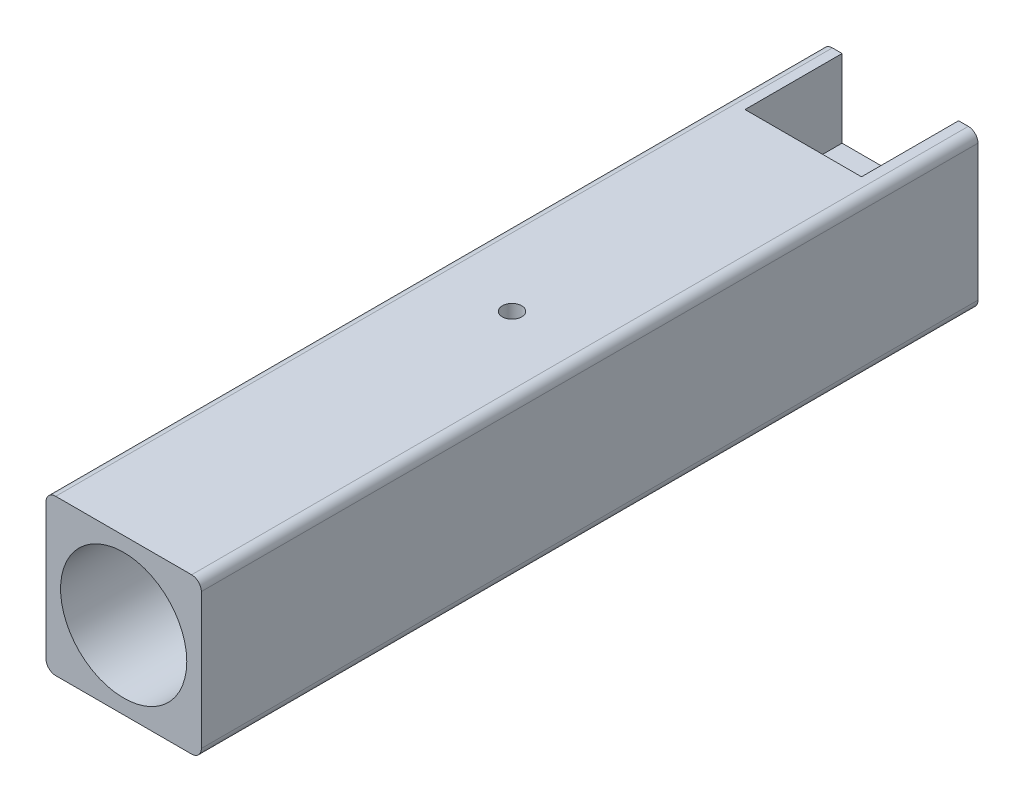
ISO-10303-21;
HEADER;
FILE_DESCRIPTION(('STEP AP214'),'2;1');
FILE_NAME('part.step','',(''),(''),'','','');
FILE_SCHEMA(('AUTOMOTIVE_DESIGN { 1 0 10303 214 1 1 1 1 }'));
ENDSEC;
DATA;
#1=APPLICATION_CONTEXT('core data for automotive mechanical design processes');
#2=APPLICATION_PROTOCOL_DEFINITION('international standard','automotive_design',2000,#1);
#3=PRODUCT_CONTEXT('',#1,'mechanical');
#4=PRODUCT('Part','Part','',(#3));
#5=PRODUCT_RELATED_PRODUCT_CATEGORY('part','',(#4));
#6=PRODUCT_DEFINITION_FORMATION('','',#4);
#7=PRODUCT_DEFINITION_CONTEXT('part definition',#1,'design');
#8=PRODUCT_DEFINITION('design','',#6,#7);
#9=PRODUCT_DEFINITION_SHAPE('','',#8);
#10=(LENGTH_UNIT() NAMED_UNIT(*) SI_UNIT(.MILLI.,.METRE.));
#11=(NAMED_UNIT(*) PLANE_ANGLE_UNIT() SI_UNIT($,.RADIAN.));
#12=(NAMED_UNIT(*) SI_UNIT($,.STERADIAN.) SOLID_ANGLE_UNIT());
#13=UNCERTAINTY_MEASURE_WITH_UNIT(LENGTH_MEASURE(1.E-05),#10,'distance_accuracy_value','');
#14=(GEOMETRIC_REPRESENTATION_CONTEXT(3) GLOBAL_UNCERTAINTY_ASSIGNED_CONTEXT((#13)) GLOBAL_UNIT_ASSIGNED_CONTEXT((#10,
#11,#12)) REPRESENTATION_CONTEXT('',''));
#15=CARTESIAN_POINT('',(0.,0.,0.));
#16=DIRECTION('',(0.,0.,1.));
#17=DIRECTION('',(1.,0.,0.));
#18=AXIS2_PLACEMENT_3D('',#15,#16,#17);
#19=CARTESIAN_POINT('',(0.,0.,80.));
#20=DIRECTION('',(1.,0.,0.));
#21=DIRECTION('',(0.,1.,0.));
#22=AXIS2_PLACEMENT_3D('',#19,#20,#21);
#23=PLANE('',#22);
#24=DIRECTION('',(0.,-1.,0.));
#25=VECTOR('',#24,1.);
#26=CARTESIAN_POINT('',(0.,0.,80.));
#27=LINE('',#26,#25);
#28=CARTESIAN_POINT('',(0.,-1.,80.));
#29=VERTEX_POINT('',#28);
#30=CARTESIAN_POINT('',(0.,-15.,80.));
#31=VERTEX_POINT('',#30);
#32=EDGE_CURVE('E260',#29,#31,#27,.T.);
#33=ORIENTED_EDGE('',*,*,#32,.F.);
#34=DIRECTION('',(0.,0.,-1.));
#35=VECTOR('',#34,1.);
#36=CARTESIAN_POINT('',(0.,-1.,80.));
#37=LINE('',#36,#35);
#38=CARTESIAN_POINT('',(0.,-1.,0.));
#39=VERTEX_POINT('',#38);
#40=EDGE_CURVE('E11',#29,#39,#37,.T.);
#41=ORIENTED_EDGE('',*,*,#40,.T.);
#42=DIRECTION('',(0.,-1.,0.));
#43=VECTOR('',#42,1.);
#44=CARTESIAN_POINT('',(0.,0.,0.));
#45=LINE('',#44,#43);
#46=CARTESIAN_POINT('',(0.,-15.,0.));
#47=VERTEX_POINT('',#46);
#48=EDGE_CURVE('E256',#39,#47,#45,.T.);
#49=ORIENTED_EDGE('',*,*,#48,.T.);
#50=DIRECTION('',(0.,0.,-1.));
#51=VECTOR('',#50,1.);
#52=CARTESIAN_POINT('',(0.,-15.,80.));
#53=LINE('',#52,#51);
#54=EDGE_CURVE('E48',#47,#31,#53,.F.);
#55=ORIENTED_EDGE('',*,*,#54,.T.);
#56=EDGE_LOOP('',(#33,#41,#49,#55));
#57=FACE_BOUND('',#56,.T.);
#58=ADVANCED_FACE('F39',(#57),#23,.F.);
#59=CARTESIAN_POINT('',(0.,-16.,80.));
#60=DIRECTION('',(0.,1.,0.));
#61=DIRECTION('',(0.,0.,1.));
#62=AXIS2_PLACEMENT_3D('',#59,#60,#61);
#63=PLANE('',#62);
#64=DIRECTION('',(1.,0.,0.));
#65=VECTOR('',#64,1.);
#66=CARTESIAN_POINT('',(0.,-16.,0.));
#67=LINE('',#66,#65);
#68=CARTESIAN_POINT('',(14.,-16.,0.));
#69=VERTEX_POINT('',#68);
#70=CARTESIAN_POINT('',(15.,-16.,0.));
#71=VERTEX_POINT('',#70);
#72=EDGE_CURVE('E279',#69,#71,#67,.T.);
#73=ORIENTED_EDGE('',*,*,#72,.T.);
#74=DIRECTION('',(0.,0.,-1.));
#75=VECTOR('',#74,1.);
#76=CARTESIAN_POINT('',(15.,-16.,80.));
#77=LINE('',#76,#75);
#78=CARTESIAN_POINT('',(15.,-16.,80.));
#79=VERTEX_POINT('',#78);
#80=EDGE_CURVE('E312',#71,#79,#77,.F.);
#81=ORIENTED_EDGE('',*,*,#80,.T.);
#82=DIRECTION('',(1.,0.,0.));
#83=VECTOR('',#82,1.);
#84=CARTESIAN_POINT('',(0.,-16.,80.));
#85=LINE('',#84,#83);
#86=CARTESIAN_POINT('',(1.,-16.,80.));
#87=VERTEX_POINT('',#86);
#88=EDGE_CURVE('E264',#87,#79,#85,.T.);
#89=ORIENTED_EDGE('',*,*,#88,.F.);
#90=DIRECTION('',(0.,0.,-1.));
#91=VECTOR('',#90,1.);
#92=CARTESIAN_POINT('',(1.,-16.,80.));
#93=LINE('',#92,#91);
#94=CARTESIAN_POINT('',(1.,-16.,0.));
#95=VERTEX_POINT('',#94);
#96=EDGE_CURVE('E308',#87,#95,#93,.T.);
#97=ORIENTED_EDGE('',*,*,#96,.T.);
#98=CARTESIAN_POINT('',(2.,-16.,0.));
#99=VERTEX_POINT('',#98);
#100=EDGE_CURVE('E280',#95,#99,#67,.T.);
#101=ORIENTED_EDGE('',*,*,#100,.T.);
#102=DIRECTION('',(0.,0.,-1.));
#103=VECTOR('',#102,1.);
#104=CARTESIAN_POINT('',(2.,-16.,10.));
#105=LINE('',#104,#103);
#106=CARTESIAN_POINT('',(2.,-16.,10.));
#107=VERTEX_POINT('',#106);
#108=EDGE_CURVE('E198',#107,#99,#105,.T.);
#109=ORIENTED_EDGE('',*,*,#108,.F.);
#110=DIRECTION('',(-1.,0.,0.));
#111=VECTOR('',#110,1.);
#112=CARTESIAN_POINT('',(14.,-16.,10.));
#113=LINE('',#112,#111);
#114=CARTESIAN_POINT('',(14.,-16.,10.));
#115=VERTEX_POINT('',#114);
#116=EDGE_CURVE('E224',#115,#107,#113,.T.);
#117=ORIENTED_EDGE('',*,*,#116,.F.);
#118=DIRECTION('',(0.,0.,-1.));
#119=VECTOR('',#118,1.);
#120=CARTESIAN_POINT('',(14.,-16.,10.));
#121=LINE('',#120,#119);
#122=EDGE_CURVE('E242',#115,#69,#121,.T.);
#123=ORIENTED_EDGE('',*,*,#122,.T.);
#124=EDGE_LOOP('',(#73,#81,#89,#97,#101,#109,#117,#123));
#125=FACE_BOUND('',#124,.T.);
#126=ADVANCED_FACE('F346',(#125),#63,.F.);
#127=CARTESIAN_POINT('',(16.,0.,80.));
#128=DIRECTION('',(-1.,0.,0.));
#129=DIRECTION('',(0.,-1.,0.));
#130=AXIS2_PLACEMENT_3D('',#127,#128,#129);
#131=PLANE('',#130);
#132=DIRECTION('',(0.,1.,0.));
#133=VECTOR('',#132,1.);
#134=CARTESIAN_POINT('',(16.,0.,80.));
#135=LINE('',#134,#133);
#136=CARTESIAN_POINT('',(16.,-15.,80.));
#137=VERTEX_POINT('',#136);
#138=CARTESIAN_POINT('',(16.,-1.,80.));
#139=VERTEX_POINT('',#138);
#140=EDGE_CURVE('E269',#137,#139,#135,.T.);
#141=ORIENTED_EDGE('',*,*,#140,.F.);
#142=DIRECTION('',(0.,0.,-1.));
#143=VECTOR('',#142,1.);
#144=CARTESIAN_POINT('',(16.,-15.,80.));
#145=LINE('',#144,#143);
#146=CARTESIAN_POINT('',(16.,-15.,0.));
#147=VERTEX_POINT('',#146);
#148=EDGE_CURVE('E292',#137,#147,#145,.T.);
#149=ORIENTED_EDGE('',*,*,#148,.T.);
#150=DIRECTION('',(0.,1.,0.));
#151=VECTOR('',#150,1.);
#152=CARTESIAN_POINT('',(16.,0.,0.));
#153=LINE('',#152,#151);
#154=CARTESIAN_POINT('',(16.,-1.,0.));
#155=VERTEX_POINT('',#154);
#156=EDGE_CURVE('E283',#147,#155,#153,.T.);
#157=ORIENTED_EDGE('',*,*,#156,.T.);
#158=DIRECTION('',(0.,0.,-1.));
#159=VECTOR('',#158,1.);
#160=CARTESIAN_POINT('',(16.,-1.,80.));
#161=LINE('',#160,#159);
#162=EDGE_CURVE('E275',#155,#139,#161,.F.);
#163=ORIENTED_EDGE('',*,*,#162,.T.);
#164=EDGE_LOOP('',(#141,#149,#157,#163));
#165=FACE_BOUND('',#164,.T.);
#166=ADVANCED_FACE('F387',(#165),#131,.F.);
#167=CARTESIAN_POINT('',(0.,0.,80.));
#168=DIRECTION('',(0.,-1.,0.));
#169=DIRECTION('',(0.,0.,-1.));
#170=AXIS2_PLACEMENT_3D('',#167,#168,#169);
#171=PLANE('',#170);
#172=CARTESIAN_POINT('',(8.,0.,40.));
#173=DIRECTION('',(0.,1.,0.));
#174=DIRECTION('',(0.,0.,1.));
#175=AXIS2_PLACEMENT_3D('',#172,#173,#174);
#176=CIRCLE('',#175,1.);
#177=CARTESIAN_POINT('',(8.,0.,41.));
#178=VERTEX_POINT('',#177);
#179=EDGE_CURVE('E604',#178,#178,#176,.T.);
#180=ORIENTED_EDGE('',*,*,#179,.F.);
#181=EDGE_LOOP('',(#180));
#182=FACE_BOUND('',#181,.T.);
#183=DIRECTION('',(-1.,0.,0.));
#184=VECTOR('',#183,1.);
#185=CARTESIAN_POINT('',(0.,0.,80.));
#186=LINE('',#185,#184);
#187=CARTESIAN_POINT('',(15.,0.,80.));
#188=VERTEX_POINT('',#187);
#189=CARTESIAN_POINT('',(1.,0.,80.));
#190=VERTEX_POINT('',#189);
#191=EDGE_CURVE('E272',#188,#190,#186,.T.);
#192=ORIENTED_EDGE('',*,*,#191,.F.);
#193=DIRECTION('',(0.,0.,-1.));
#194=VECTOR('',#193,1.);
#195=CARTESIAN_POINT('',(15.,0.,80.));
#196=LINE('',#195,#194);
#197=CARTESIAN_POINT('',(15.,0.,0.));
#198=VERTEX_POINT('',#197);
#199=EDGE_CURVE('E328',#188,#198,#196,.T.);
#200=ORIENTED_EDGE('',*,*,#199,.T.);
#201=DIRECTION('',(-1.,0.,0.));
#202=VECTOR('',#201,1.);
#203=CARTESIAN_POINT('',(0.,0.,0.));
#204=LINE('',#203,#202);
#205=CARTESIAN_POINT('',(14.,0.,0.));
#206=VERTEX_POINT('',#205);
#207=EDGE_CURVE('E265',#198,#206,#204,.T.);
#208=ORIENTED_EDGE('',*,*,#207,.T.);
#209=DIRECTION('',(0.,0.,-1.));
#210=VECTOR('',#209,1.);
#211=CARTESIAN_POINT('',(14.,0.,10.));
#212=LINE('',#211,#210);
#213=CARTESIAN_POINT('',(14.,0.,10.));
#214=VERTEX_POINT('',#213);
#215=EDGE_CURVE('E201',#214,#206,#212,.T.);
#216=ORIENTED_EDGE('',*,*,#215,.F.);
#217=DIRECTION('',(1.,0.,0.));
#218=VECTOR('',#217,1.);
#219=CARTESIAN_POINT('',(14.,0.,10.));
#220=LINE('',#219,#218);
#221=CARTESIAN_POINT('',(2.,0.,10.));
#222=VERTEX_POINT('',#221);
#223=EDGE_CURVE('E168',#222,#214,#220,.T.);
#224=ORIENTED_EDGE('',*,*,#223,.F.);
#225=DIRECTION('',(0.,0.,-1.));
#226=VECTOR('',#225,1.);
#227=CARTESIAN_POINT('',(2.,0.,10.));
#228=LINE('',#227,#226);
#229=CARTESIAN_POINT('',(2.,0.,0.));
#230=VERTEX_POINT('',#229);
#231=EDGE_CURVE('E205',#222,#230,#228,.T.);
#232=ORIENTED_EDGE('',*,*,#231,.T.);
#233=CARTESIAN_POINT('',(1.,0.,0.));
#234=VERTEX_POINT('',#233);
#235=EDGE_CURVE('E287',#230,#234,#204,.T.);
#236=ORIENTED_EDGE('',*,*,#235,.T.);
#237=DIRECTION('',(0.,0.,-1.));
#238=VECTOR('',#237,1.);
#239=CARTESIAN_POINT('',(1.,0.,80.));
#240=LINE('',#239,#238);
#241=EDGE_CURVE('E55',#234,#190,#240,.F.);
#242=ORIENTED_EDGE('',*,*,#241,.T.);
#243=EDGE_LOOP('',(#192,#200,#208,#216,#224,#232,#236,#242));
#244=FACE_BOUND('',#243,.T.);
#245=ADVANCED_FACE('F369',(#182,#244),#171,.F.);
#246=CARTESIAN_POINT('',(0.,0.,80.));
#247=DIRECTION('',(0.,0.,1.));
#248=DIRECTION('',(1.,0.,0.));
#249=AXIS2_PLACEMENT_3D('',#246,#247,#248);
#250=PLANE('',#249);
#251=CARTESIAN_POINT('',(8.,-8.,80.));
#252=DIRECTION('',(0.,0.,1.));
#253=DIRECTION('',(1.,0.,0.));
#254=AXIS2_PLACEMENT_3D('',#251,#252,#253);
#255=CIRCLE('',#254,6.5);
#256=CARTESIAN_POINT('',(14.5,-8.,80.));
#257=VERTEX_POINT('',#256);
#258=EDGE_CURVE('E204',#257,#257,#255,.T.);
#259=ORIENTED_EDGE('',*,*,#258,.F.);
#260=EDGE_LOOP('',(#259));
#261=FACE_BOUND('',#260,.T.);
#262=ORIENTED_EDGE('',*,*,#88,.T.);
#263=CARTESIAN_POINT('',(15.,-15.,80.));
#264=DIRECTION('',(0.,0.,1.));
#265=DIRECTION('',(1.,0.,0.));
#266=AXIS2_PLACEMENT_3D('',#263,#264,#265);
#267=CIRCLE('',#266,1.);
#268=EDGE_CURVE('E323',#79,#137,#267,.T.);
#269=ORIENTED_EDGE('',*,*,#268,.T.);
#270=ORIENTED_EDGE('',*,*,#140,.T.);
#271=CARTESIAN_POINT('',(15.,-1.,80.));
#272=DIRECTION('',(0.,0.,1.));
#273=DIRECTION('',(1.,0.,0.));
#274=AXIS2_PLACEMENT_3D('',#271,#272,#273);
#275=CIRCLE('',#274,1.);
#276=EDGE_CURVE('E62',#139,#188,#275,.T.);
#277=ORIENTED_EDGE('',*,*,#276,.T.);
#278=ORIENTED_EDGE('',*,*,#191,.T.);
#279=CARTESIAN_POINT('',(1.,-1.,80.));
#280=DIRECTION('',(0.,0.,1.));
#281=DIRECTION('',(1.,0.,0.));
#282=AXIS2_PLACEMENT_3D('',#279,#280,#281);
#283=CIRCLE('',#282,1.);
#284=EDGE_CURVE('E318',#190,#29,#283,.T.);
#285=ORIENTED_EDGE('',*,*,#284,.T.);
#286=ORIENTED_EDGE('',*,*,#32,.T.);
#287=CARTESIAN_POINT('',(1.,-15.,80.));
#288=DIRECTION('',(0.,0.,1.));
#289=DIRECTION('',(1.,0.,0.));
#290=AXIS2_PLACEMENT_3D('',#287,#288,#289);
#291=CIRCLE('',#290,1.);
#292=EDGE_CURVE('E315',#31,#87,#291,.T.);
#293=ORIENTED_EDGE('',*,*,#292,.T.);
#294=EDGE_LOOP('',(#262,#269,#270,#277,#278,#285,#286,#293));
#295=FACE_BOUND('',#294,.T.);
#296=ADVANCED_FACE('F339',(#261,#295),#250,.T.);
#297=CARTESIAN_POINT('',(0.,0.,0.));
#298=DIRECTION('',(0.,0.,1.));
#299=DIRECTION('',(1.,0.,0.));
#300=AXIS2_PLACEMENT_3D('',#297,#298,#299);
#301=PLANE('',#300);
#302=ORIENTED_EDGE('',*,*,#156,.F.);
#303=CARTESIAN_POINT('',(15.,-15.,0.));
#304=DIRECTION('',(0.,0.,1.));
#305=DIRECTION('',(1.,0.,0.));
#306=AXIS2_PLACEMENT_3D('',#303,#304,#305);
#307=CIRCLE('',#306,1.);
#308=EDGE_CURVE('E305',#147,#71,#307,.F.);
#309=ORIENTED_EDGE('',*,*,#308,.T.);
#310=ORIENTED_EDGE('',*,*,#72,.F.);
#311=DIRECTION('',(0.,-1.,0.));
#312=VECTOR('',#311,1.);
#313=CARTESIAN_POINT('',(14.,-13.,0.));
#314=LINE('',#313,#312);
#315=CARTESIAN_POINT('',(14.,-13.,0.));
#316=VERTEX_POINT('',#315);
#317=EDGE_CURVE('E216',#316,#69,#314,.T.);
#318=ORIENTED_EDGE('',*,*,#317,.F.);
#319=DIRECTION('',(1.,0.,0.));
#320=VECTOR('',#319,1.);
#321=CARTESIAN_POINT('',(14.,-13.,0.));
#322=LINE('',#321,#320);
#323=CARTESIAN_POINT('',(2.,-13.,0.));
#324=VERTEX_POINT('',#323);
#325=EDGE_CURVE('E232',#324,#316,#322,.T.);
#326=ORIENTED_EDGE('',*,*,#325,.F.);
#327=DIRECTION('',(0.,1.,0.));
#328=VECTOR('',#327,1.);
#329=CARTESIAN_POINT('',(2.,-13.,0.));
#330=LINE('',#329,#328);
#331=EDGE_CURVE('E229',#99,#324,#330,.T.);
#332=ORIENTED_EDGE('',*,*,#331,.F.);
#333=ORIENTED_EDGE('',*,*,#100,.F.);
#334=CARTESIAN_POINT('',(1.,-15.,0.));
#335=DIRECTION('',(0.,0.,1.));
#336=DIRECTION('',(1.,0.,0.));
#337=AXIS2_PLACEMENT_3D('',#334,#335,#336);
#338=CIRCLE('',#337,1.);
#339=EDGE_CURVE('E296',#95,#47,#338,.F.);
#340=ORIENTED_EDGE('',*,*,#339,.T.);
#341=ORIENTED_EDGE('',*,*,#48,.F.);
#342=CARTESIAN_POINT('',(1.,-1.,0.));
#343=DIRECTION('',(0.,0.,1.));
#344=DIRECTION('',(1.,0.,0.));
#345=AXIS2_PLACEMENT_3D('',#342,#343,#344);
#346=CIRCLE('',#345,1.);
#347=EDGE_CURVE('E299',#39,#234,#346,.F.);
#348=ORIENTED_EDGE('',*,*,#347,.T.);
#349=ORIENTED_EDGE('',*,*,#235,.F.);
#350=DIRECTION('',(0.,1.,0.));
#351=VECTOR('',#350,1.);
#352=CARTESIAN_POINT('',(2.,0.,0.));
#353=LINE('',#352,#351);
#354=CARTESIAN_POINT('',(2.,-8.,0.));
#355=VERTEX_POINT('',#354);
#356=EDGE_CURVE('E183',#355,#230,#353,.T.);
#357=ORIENTED_EDGE('',*,*,#356,.F.);
#358=DIRECTION('',(-1.,0.,0.));
#359=VECTOR('',#358,1.);
#360=CARTESIAN_POINT('',(14.,-8.,0.));
#361=LINE('',#360,#359);
#362=CARTESIAN_POINT('',(14.,-8.,0.));
#363=VERTEX_POINT('',#362);
#364=EDGE_CURVE('E186',#363,#355,#361,.T.);
#365=ORIENTED_EDGE('',*,*,#364,.F.);
#366=DIRECTION('',(0.,-1.,0.));
#367=VECTOR('',#366,1.);
#368=CARTESIAN_POINT('',(14.,0.,0.));
#369=LINE('',#368,#367);
#370=EDGE_CURVE('E162',#206,#363,#369,.T.);
#371=ORIENTED_EDGE('',*,*,#370,.F.);
#372=ORIENTED_EDGE('',*,*,#207,.F.);
#373=CARTESIAN_POINT('',(15.,-1.,0.));
#374=DIRECTION('',(0.,0.,1.));
#375=DIRECTION('',(1.,0.,0.));
#376=AXIS2_PLACEMENT_3D('',#373,#374,#375);
#377=CIRCLE('',#376,1.);
#378=EDGE_CURVE('E302',#198,#155,#377,.F.);
#379=ORIENTED_EDGE('',*,*,#378,.T.);
#380=EDGE_LOOP('',(#302,#309,#310,#318,#326,#332,#333,#340,#341,#348,#349,#357,#365,#371,#372,#379));
#381=FACE_BOUND('',#380,.T.);
#382=ADVANCED_FACE('F351',(#381),#301,.F.);
#383=CARTESIAN_POINT('',(8.,-8.,30.));
#384=DIRECTION('',(0.,0.,1.));
#385=DIRECTION('',(1.,0.,0.));
#386=AXIS2_PLACEMENT_3D('',#383,#384,#385);
#387=CYLINDRICAL_SURFACE('',#386,6.5);
#388=CARTESIAN_POINT('',(8.,-1.5,41.));
#389=CARTESIAN_POINT('',(7.94418293527011,-1.50000091007833,40.9999977115017));
#390=CARTESIAN_POINT('',(7.88833390853544,-1.50072649656726,40.9953109036835));
#391=CARTESIAN_POINT('',(7.778198100176,-1.50355116436071,40.9766929268117));
#392=CARTESIAN_POINT('',(7.72391287338665,-1.50565156651803,40.9627528675239));
#393=CARTESIAN_POINT('',(7.61851438911649,-1.51098992748212,40.9260557776658));
#394=CARTESIAN_POINT('',(7.56739872528542,-1.51422701055826,40.9033055333236));
#395=CARTESIAN_POINT('',(7.46971791472895,-1.52148143015368,40.8496507225243));
#396=CARTESIAN_POINT('',(7.4231521620281,-1.52549866255604,40.8187472439817));
#397=CARTESIAN_POINT('',(7.33550361398763,-1.53390379844021,40.749393273145));
#398=CARTESIAN_POINT('',(7.29446353926895,-1.53829420454649,40.7108890887262));
#399=CARTESIAN_POINT('',(7.21940000881251,-1.54693137043103,40.6275422491858));
#400=CARTESIAN_POINT('',(7.18537696508785,-1.55117812176221,40.5826992221322));
#401=CARTESIAN_POINT('',(7.12514587882975,-1.55907141519071,40.4876591386071));
#402=CARTESIAN_POINT('',(7.09897937484975,-1.56271472290099,40.4374354653675));
#403=CARTESIAN_POINT('',(7.05546963337092,-1.56895432313369,40.3332405604673));
#404=CARTESIAN_POINT('',(7.03812588970214,-1.57155067571913,40.2792695439973));
#405=CARTESIAN_POINT('',(7.01288710433819,-1.5753777211851,40.1695621045227));
#406=CARTESIAN_POINT('',(7.00491878262112,-1.57661899998033,40.1138429160574));
#407=CARTESIAN_POINT('',(6.99842997534258,-1.57762746720937,40.0018455350476));
#408=CARTESIAN_POINT('',(6.99990891948757,-1.57739474462272,39.9455673764507));
#409=CARTESIAN_POINT('',(7.01221282018818,-1.57549118066874,39.8345684481683));
#410=CARTESIAN_POINT('',(7.02295600555835,-1.57383292224551,39.7798383674451));
#411=CARTESIAN_POINT('',(7.05335535302759,-1.56928479564967,39.6729669588678));
#412=CARTESIAN_POINT('',(7.07301177922297,-1.56639489098396,39.6208257077707));
#413=CARTESIAN_POINT('',(7.12076420491597,-1.55969526041189,39.5203641511495));
#414=CARTESIAN_POINT('',(7.1488946891951,-1.55588178876613,39.4720604973275));
#415=CARTESIAN_POINT('',(7.21277216762589,-1.5477673896381,39.3808281253323));
#416=CARTESIAN_POINT('',(7.2485196872089,-1.54346642853787,39.337899778278));
#417=CARTESIAN_POINT('',(7.32706461294525,-1.53480613243941,39.2581628113787));
#418=CARTESIAN_POINT('',(7.36993229137565,-1.530446659662,39.2214233929631));
#419=CARTESIAN_POINT('',(7.46126158213438,-1.52220255958654,39.1556495480845));
#420=CARTESIAN_POINT('',(7.50972322131474,-1.51831793456803,39.1266151586093));
#421=CARTESIAN_POINT('',(7.61092589538906,-1.511456854546,39.0770713874046));
#422=CARTESIAN_POINT('',(7.66366967036832,-1.50848098693611,39.0565675164579));
#423=CARTESIAN_POINT('',(7.77190795915462,-1.503777585527,39.0247278716282));
#424=CARTESIAN_POINT('',(7.82740227694362,-1.50204996290763,39.0133914454194));
#425=CARTESIAN_POINT('',(7.93896929317186,-1.50004951119551,39.0003009059104));
#426=CARTESIAN_POINT('',(7.99503058292585,-1.49976224355701,38.998451685667));
#427=CARTESIAN_POINT('',(8.10666252934637,-1.50063551210768,39.0041353598021));
#428=CARTESIAN_POINT('',(8.16223320195536,-1.50179600107675,39.011667948183));
#429=CARTESIAN_POINT('',(8.27101712424826,-1.50542545810717,39.0358223253044));
#430=CARTESIAN_POINT('',(8.32424094186449,-1.50788772976769,39.0523976119831));
#431=CARTESIAN_POINT('',(8.42715414396984,-1.51384561301543,39.0941177171811));
#432=CARTESIAN_POINT('',(8.47684335492824,-1.51734127529337,39.1192629560898));
#433=CARTESIAN_POINT('',(8.57169392957572,-1.52501350116668,39.1776311333932));
#434=CARTESIAN_POINT('',(8.61681788249644,-1.52919505303499,39.2109141978776));
#435=CARTESIAN_POINT('',(8.70087369759262,-1.53775855790866,39.2845297547096));
#436=CARTESIAN_POINT('',(8.73980517987215,-1.54214052318778,39.324862679234));
#437=CARTESIAN_POINT('',(8.81071843588531,-1.55065696523141,39.4118571654747));
#438=CARTESIAN_POINT('',(8.84263634127065,-1.55478893767585,39.458571072027));
#439=CARTESIAN_POINT('',(8.89817200187627,-1.56229266952366,39.5567531882258));
#440=CARTESIAN_POINT('',(8.92178999039054,-1.56566445029353,39.6082212641907));
#441=CARTESIAN_POINT('',(8.95995716610431,-1.57124775458982,39.7142629174924));
#442=CARTESIAN_POINT('',(8.97453955891243,-1.57346352163725,39.7688243099208));
#443=CARTESIAN_POINT('',(8.99432703622355,-1.57649506450231,39.8796585061016));
#444=CARTESIAN_POINT('',(8.99953280501649,-1.57731094248124,39.9359311846625));
#445=CARTESIAN_POINT('',(9.00040235728519,-1.57744638350591,40.0479537351227));
#446=CARTESIAN_POINT('',(8.99616658546235,-1.57678169771789,40.1037028341675));
#447=CARTESIAN_POINT('',(8.97848897403827,-1.57406520072176,40.2136856050271));
#448=CARTESIAN_POINT('',(8.96504715231478,-1.57201339220737,40.2679192797844));
#449=CARTESIAN_POINT('',(8.9293751910431,-1.56675945057788,40.3733014206188));
#450=CARTESIAN_POINT('',(8.90715243517895,-1.56355828413726,40.4244524372895));
#451=CARTESIAN_POINT('',(8.8545594858829,-1.55636519779832,40.5223163344906));
#452=CARTESIAN_POINT('',(8.82418898778991,-1.55237324833244,40.569029048975));
#453=CARTESIAN_POINT('',(8.75579915020177,-1.54399790017012,40.657200048572));
#454=CARTESIAN_POINT('',(8.71770552295379,-1.53961094920033,40.6986003819844));
#455=CARTESIAN_POINT('',(8.63510775799318,-1.53096925619011,40.7744563809813));
#456=CARTESIAN_POINT('',(8.59060213505272,-1.52671454505911,40.8089104331314));
#457=CARTESIAN_POINT('',(8.49613886114841,-1.5187883956101,40.8700756070559));
#458=CARTESIAN_POINT('',(8.44615104976805,-1.51512048799494,40.8967406016962));
#459=CARTESIAN_POINT('',(8.34237256340943,-1.5088157585084,40.9412557317142));
#460=CARTESIAN_POINT('',(8.28858585895337,-1.50617787836833,40.9591149193205));
#461=CARTESIAN_POINT('',(8.19547070003454,-1.50282671359392,40.9814985687347));
#462=CARTESIAN_POINT('',(8.15671458766326,-1.50177218889927,40.98842589073));
#463=CARTESIAN_POINT('',(8.07864426819718,-1.50035851613475,40.9976773817535));
#464=CARTESIAN_POINT('',(8.03933006859624,-1.49999935873655,41.0000016125319));
#465=CARTESIAN_POINT('',(8.,-1.5,41.));
#466=B_SPLINE_CURVE_WITH_KNOTS('',3,(#388,#389,#390,#391,#392,#393,#394,#395,#396,#397,#398,
#399,#400,#401,#402,#403,#404,#405,#406,#407,#408,#409,#410,#411,#412,#413,#414,#415,#416,#417,
#418,#419,#420,#421,#422,#423,#424,#425,#426,#427,#428,#429,#430,#431,#432,#433,#434,#435,#436,
#437,#438,#439,#440,#441,#442,#443,#444,#445,#446,#447,#448,#449,#450,#451,#452,#453,#454,#455,
#456,#457,#458,#459,#460,#461,#462,#463,#464,#465),.UNSPECIFIED.,.T.,.F.,(4,2,2,2,2,2,2,2,2,2,2,
2,2,2,2,2,2,2,2,2,2,2,2,2,2,2,2,2,2,2,2,2,2,2,2,2,2,2,4),(0.,0.167307467701377,
0.334775912289478,0.502115616587678,0.669433003445579,0.837977603302102,1.00653209663435,
1.17596267229177,1.34538352646322,1.51347116858973,1.68154866403561,1.84815762731508,
2.01477152748462,2.18207283092673,2.34938567873228,2.51846034912151,2.68753583113344,
2.85672036828736,3.02589286575469,3.1933660891714,3.36083385041674,3.52744841736625,
3.69407115858383,3.86196430272233,4.02986774280724,4.1992420476724,4.36861159138526,
4.53735495577968,4.70608600507343,4.87303057013561,5.03997481099963,5.20677897004387,
5.37358936711326,5.5420876922292,5.71062511000445,5.88014126810579,6.04948280110169,
6.16737331520002,6.28526224779082),.UNSPECIFIED.);
#467=CARTESIAN_POINT('',(8.,-1.5,41.));
#468=VERTEX_POINT('',#467);
#469=EDGE_CURVE('E597',#468,#468,#466,.T.);
#470=ORIENTED_EDGE('',*,*,#469,.F.);
#471=EDGE_LOOP('',(#470));
#472=FACE_BOUND('',#471,.T.);
#473=CARTESIAN_POINT('',(8.,-8.,30.));
#474=DIRECTION('',(0.,0.,1.));
#475=DIRECTION('',(1.,0.,0.));
#476=AXIS2_PLACEMENT_3D('',#473,#474,#475);
#477=CIRCLE('',#476,6.5);
#478=CARTESIAN_POINT('',(14.5,-8.,30.));
#479=VERTEX_POINT('',#478);
#480=EDGE_CURVE('E252',#479,#479,#477,.T.);
#481=ORIENTED_EDGE('',*,*,#480,.F.);
#482=EDGE_LOOP('',(#481));
#483=FACE_BOUND('',#482,.T.);
#484=ORIENTED_EDGE('',*,*,#258,.T.);
#485=EDGE_LOOP('',(#484));
#486=FACE_BOUND('',#485,.T.);
#487=ADVANCED_FACE('F434',(#472,#483,#486),#387,.F.);
#488=CARTESIAN_POINT('',(8.,-8.,30.));
#489=DIRECTION('',(0.,0.,1.));
#490=DIRECTION('',(1.,0.,0.));
#491=AXIS2_PLACEMENT_3D('',#488,#489,#490);
#492=PLANE('',#491);
#493=ORIENTED_EDGE('',*,*,#480,.T.);
#494=EDGE_LOOP('',(#493));
#495=FACE_BOUND('',#494,.T.);
#496=ADVANCED_FACE('F431',(#495),#492,.T.);
#497=CARTESIAN_POINT('',(2.,-13.,10.));
#498=DIRECTION('',(-1.,0.,0.));
#499=DIRECTION('',(0.,0.,1.));
#500=AXIS2_PLACEMENT_3D('',#497,#498,#499);
#501=PLANE('',#500);
#502=ORIENTED_EDGE('',*,*,#331,.T.);
#503=DIRECTION('',(0.,0.,-1.));
#504=VECTOR('',#503,1.);
#505=CARTESIAN_POINT('',(2.,-13.,10.));
#506=LINE('',#505,#504);
#507=CARTESIAN_POINT('',(2.,-13.,10.));
#508=VERTEX_POINT('',#507);
#509=EDGE_CURVE('E228',#508,#324,#506,.T.);
#510=ORIENTED_EDGE('',*,*,#509,.F.);
#511=DIRECTION('',(0.,1.,0.));
#512=VECTOR('',#511,1.);
#513=CARTESIAN_POINT('',(2.,-13.,10.));
#514=LINE('',#513,#512);
#515=EDGE_CURVE('E211',#107,#508,#514,.T.);
#516=ORIENTED_EDGE('',*,*,#515,.F.);
#517=ORIENTED_EDGE('',*,*,#108,.T.);
#518=EDGE_LOOP('',(#502,#510,#516,#517));
#519=FACE_BOUND('',#518,.T.);
#520=ADVANCED_FACE('F355',(#519),#501,.F.);
#521=CARTESIAN_POINT('',(14.,-13.,10.));
#522=DIRECTION('',(1.,0.,0.));
#523=DIRECTION('',(0.,0.,-1.));
#524=AXIS2_PLACEMENT_3D('',#521,#522,#523);
#525=PLANE('',#524);
#526=ORIENTED_EDGE('',*,*,#317,.T.);
#527=ORIENTED_EDGE('',*,*,#122,.F.);
#528=DIRECTION('',(0.,-1.,0.));
#529=VECTOR('',#528,1.);
#530=CARTESIAN_POINT('',(14.,-13.,10.));
#531=LINE('',#530,#529);
#532=CARTESIAN_POINT('',(14.,-13.,10.));
#533=VERTEX_POINT('',#532);
#534=EDGE_CURVE('E220',#533,#115,#531,.T.);
#535=ORIENTED_EDGE('',*,*,#534,.F.);
#536=DIRECTION('',(0.,0.,-1.));
#537=VECTOR('',#536,1.);
#538=CARTESIAN_POINT('',(14.,-13.,10.));
#539=LINE('',#538,#537);
#540=EDGE_CURVE('E246',#533,#316,#539,.T.);
#541=ORIENTED_EDGE('',*,*,#540,.T.);
#542=EDGE_LOOP('',(#526,#527,#535,#541));
#543=FACE_BOUND('',#542,.T.);
#544=ADVANCED_FACE('F423',(#543),#525,.F.);
#545=CARTESIAN_POINT('',(14.,-13.,10.));
#546=DIRECTION('',(0.,1.,0.));
#547=DIRECTION('',(0.,0.,1.));
#548=AXIS2_PLACEMENT_3D('',#545,#546,#547);
#549=PLANE('',#548);
#550=CARTESIAN_POINT('',(8.,-13.,5.));
#551=DIRECTION('',(0.,-1.,0.));
#552=DIRECTION('',(0.,0.,-1.));
#553=AXIS2_PLACEMENT_3D('',#550,#551,#552);
#554=CIRCLE('',#553,3.25);
#555=CARTESIAN_POINT('',(8.,-13.,1.75));
#556=VERTEX_POINT('',#555);
#557=EDGE_CURVE('E189',#556,#556,#554,.T.);
#558=ORIENTED_EDGE('',*,*,#557,.F.);
#559=EDGE_LOOP('',(#558));
#560=FACE_BOUND('',#559,.T.);
#561=ORIENTED_EDGE('',*,*,#325,.T.);
#562=ORIENTED_EDGE('',*,*,#540,.F.);
#563=DIRECTION('',(1.,0.,0.));
#564=VECTOR('',#563,1.);
#565=CARTESIAN_POINT('',(14.,-13.,10.));
#566=LINE('',#565,#564);
#567=EDGE_CURVE('E215',#508,#533,#566,.T.);
#568=ORIENTED_EDGE('',*,*,#567,.F.);
#569=ORIENTED_EDGE('',*,*,#509,.T.);
#570=EDGE_LOOP('',(#561,#562,#568,#569));
#571=FACE_BOUND('',#570,.T.);
#572=ADVANCED_FACE('F358',(#560,#571),#549,.F.);
#573=CARTESIAN_POINT('',(0.,0.,10.));
#574=DIRECTION('',(0.,0.,-1.));
#575=DIRECTION('',(-1.,0.,0.));
#576=AXIS2_PLACEMENT_3D('',#573,#574,#575);
#577=PLANE('',#576);
#578=ORIENTED_EDGE('',*,*,#515,.T.);
#579=ORIENTED_EDGE('',*,*,#567,.T.);
#580=ORIENTED_EDGE('',*,*,#534,.T.);
#581=ORIENTED_EDGE('',*,*,#116,.T.);
#582=EDGE_LOOP('',(#578,#579,#580,#581));
#583=FACE_BOUND('',#582,.T.);
#584=ADVANCED_FACE('F361',(#583),#577,.T.);
#585=CARTESIAN_POINT('',(14.,0.,10.));
#586=DIRECTION('',(1.,0.,0.));
#587=DIRECTION('',(0.,1.,0.));
#588=AXIS2_PLACEMENT_3D('',#585,#586,#587);
#589=PLANE('',#588);
#590=ORIENTED_EDGE('',*,*,#370,.T.);
#591=DIRECTION('',(0.,0.,-1.));
#592=VECTOR('',#591,1.);
#593=CARTESIAN_POINT('',(14.,-8.,10.));
#594=LINE('',#593,#592);
#595=CARTESIAN_POINT('',(14.,-8.,10.));
#596=VERTEX_POINT('',#595);
#597=EDGE_CURVE('E154',#596,#363,#594,.T.);
#598=ORIENTED_EDGE('',*,*,#597,.F.);
#599=DIRECTION('',(0.,-1.,0.));
#600=VECTOR('',#599,1.);
#601=CARTESIAN_POINT('',(14.,0.,10.));
#602=LINE('',#601,#600);
#603=EDGE_CURVE('E159',#214,#596,#602,.T.);
#604=ORIENTED_EDGE('',*,*,#603,.F.);
#605=ORIENTED_EDGE('',*,*,#215,.T.);
#606=EDGE_LOOP('',(#590,#598,#604,#605));
#607=FACE_BOUND('',#606,.T.);
#608=ADVANCED_FACE('F156',(#607),#589,.F.);
#609=CARTESIAN_POINT('',(2.,0.,10.));
#610=DIRECTION('',(-1.,0.,0.));
#611=DIRECTION('',(0.,-1.,0.));
#612=AXIS2_PLACEMENT_3D('',#609,#610,#611);
#613=PLANE('',#612);
#614=ORIENTED_EDGE('',*,*,#356,.T.);
#615=ORIENTED_EDGE('',*,*,#231,.F.);
#616=DIRECTION('',(0.,1.,0.));
#617=VECTOR('',#616,1.);
#618=CARTESIAN_POINT('',(2.,0.,10.));
#619=LINE('',#618,#617);
#620=CARTESIAN_POINT('',(2.,-8.,10.));
#621=VERTEX_POINT('',#620);
#622=EDGE_CURVE('E177',#621,#222,#619,.T.);
#623=ORIENTED_EDGE('',*,*,#622,.F.);
#624=DIRECTION('',(0.,0.,-1.));
#625=VECTOR('',#624,1.);
#626=CARTESIAN_POINT('',(2.,-8.,10.));
#627=LINE('',#626,#625);
#628=EDGE_CURVE('E167',#621,#355,#627,.T.);
#629=ORIENTED_EDGE('',*,*,#628,.T.);
#630=EDGE_LOOP('',(#614,#615,#623,#629));
#631=FACE_BOUND('',#630,.T.);
#632=ADVANCED_FACE('F408',(#631),#613,.F.);
#633=CARTESIAN_POINT('',(14.,-8.,10.));
#634=DIRECTION('',(0.,-1.,0.));
#635=DIRECTION('',(0.,0.,-1.));
#636=AXIS2_PLACEMENT_3D('',#633,#634,#635);
#637=PLANE('',#636);
#638=CARTESIAN_POINT('',(8.,-8.,5.));
#639=DIRECTION('',(0.,-1.,0.));
#640=DIRECTION('',(0.,0.,-1.));
#641=AXIS2_PLACEMENT_3D('',#638,#639,#640);
#642=CIRCLE('',#641,1.64999999999999);
#643=CARTESIAN_POINT('',(8.,-8.,3.35000000000001));
#644=VERTEX_POINT('',#643);
#645=EDGE_CURVE('E612',#644,#644,#642,.T.);
#646=ORIENTED_EDGE('',*,*,#645,.T.);
#647=EDGE_LOOP('',(#646));
#648=FACE_BOUND('',#647,.T.);
#649=ORIENTED_EDGE('',*,*,#364,.T.);
#650=ORIENTED_EDGE('',*,*,#628,.F.);
#651=DIRECTION('',(-1.,0.,0.));
#652=VECTOR('',#651,1.);
#653=CARTESIAN_POINT('',(14.,-8.,10.));
#654=LINE('',#653,#652);
#655=EDGE_CURVE('E171',#596,#621,#654,.T.);
#656=ORIENTED_EDGE('',*,*,#655,.F.);
#657=ORIENTED_EDGE('',*,*,#597,.T.);
#658=EDGE_LOOP('',(#649,#650,#656,#657));
#659=FACE_BOUND('',#658,.T.);
#660=ADVANCED_FACE('F172',(#648,#659),#637,.F.);
#661=CARTESIAN_POINT('',(0.,0.,10.));
#662=DIRECTION('',(0.,0.,-1.));
#663=DIRECTION('',(-1.,0.,0.));
#664=AXIS2_PLACEMENT_3D('',#661,#662,#663);
#665=PLANE('',#664);
#666=ORIENTED_EDGE('',*,*,#603,.T.);
#667=ORIENTED_EDGE('',*,*,#655,.T.);
#668=ORIENTED_EDGE('',*,*,#622,.T.);
#669=ORIENTED_EDGE('',*,*,#223,.T.);
#670=EDGE_LOOP('',(#666,#667,#668,#669));
#671=FACE_BOUND('',#670,.T.);
#672=ADVANCED_FACE('F179',(#671),#665,.T.);
#673=CARTESIAN_POINT('',(8.,-12.,5.));
#674=DIRECTION('',(0.,-1.,0.));
#675=DIRECTION('',(0.,0.,-1.));
#676=AXIS2_PLACEMENT_3D('',#673,#674,#675);
#677=CYLINDRICAL_SURFACE('',#676,3.25);
#678=CARTESIAN_POINT('',(8.,-12.,5.));
#679=DIRECTION('',(0.,-1.,0.));
#680=DIRECTION('',(0.,0.,-1.));
#681=AXIS2_PLACEMENT_3D('',#678,#679,#680);
#682=CIRCLE('',#681,3.25);
#683=CARTESIAN_POINT('',(8.,-12.,1.75));
#684=VERTEX_POINT('',#683);
#685=EDGE_CURVE('E233',#684,#684,#682,.T.);
#686=ORIENTED_EDGE('',*,*,#685,.F.);
#687=EDGE_LOOP('',(#686));
#688=FACE_BOUND('',#687,.T.);
#689=ORIENTED_EDGE('',*,*,#557,.T.);
#690=EDGE_LOOP('',(#689));
#691=FACE_BOUND('',#690,.T.);
#692=ADVANCED_FACE('F507',(#688,#691),#677,.F.);
#693=CARTESIAN_POINT('',(8.,-12.,5.));
#694=DIRECTION('',(0.,-1.,0.));
#695=DIRECTION('',(0.,0.,-1.));
#696=AXIS2_PLACEMENT_3D('',#693,#694,#695);
#697=PLANE('',#696);
#698=CARTESIAN_POINT('',(8.,-12.,5.));
#699=DIRECTION('',(0.,-1.,0.));
#700=DIRECTION('',(0.,0.,-1.));
#701=AXIS2_PLACEMENT_3D('',#698,#699,#700);
#702=CIRCLE('',#701,1.64999999999999);
#703=CARTESIAN_POINT('',(8.,-12.,3.35000000000001));
#704=VERTEX_POINT('',#703);
#705=EDGE_CURVE('E608',#704,#704,#702,.T.);
#706=ORIENTED_EDGE('',*,*,#705,.F.);
#707=EDGE_LOOP('',(#706));
#708=FACE_BOUND('',#707,.T.);
#709=ORIENTED_EDGE('',*,*,#685,.T.);
#710=EDGE_LOOP('',(#709));
#711=FACE_BOUND('',#710,.T.);
#712=ADVANCED_FACE('F517',(#708,#711),#697,.T.);
#713=CARTESIAN_POINT('',(8.,-12.,5.));
#714=DIRECTION('',(0.,-1.,0.));
#715=DIRECTION('',(0.,0.,-1.));
#716=AXIS2_PLACEMENT_3D('',#713,#714,#715);
#717=CYLINDRICAL_SURFACE('',#716,1.64999999999999);
#718=ORIENTED_EDGE('',*,*,#645,.F.);
#719=EDGE_LOOP('',(#718));
#720=FACE_BOUND('',#719,.T.);
#721=ORIENTED_EDGE('',*,*,#705,.T.);
#722=EDGE_LOOP('',(#721));
#723=FACE_BOUND('',#722,.T.);
#724=ADVANCED_FACE('F397',(#720,#723),#717,.F.);
#725=CARTESIAN_POINT('',(8.,-16.001,40.));
#726=DIRECTION('',(0.,1.,0.));
#727=DIRECTION('',(0.,0.,1.));
#728=AXIS2_PLACEMENT_3D('',#725,#726,#727);
#729=CYLINDRICAL_SURFACE('',#728,1.);
#730=ORIENTED_EDGE('',*,*,#179,.T.);
#731=EDGE_LOOP('',(#730));
#732=FACE_BOUND('',#731,.T.);
#733=ORIENTED_EDGE('',*,*,#469,.T.);
#734=EDGE_LOOP('',(#733));
#735=FACE_BOUND('',#734,.T.);
#736=ADVANCED_FACE('F392',(#732,#735),#729,.F.);
#737=CARTESIAN_POINT('',(15.,-15.,80.));
#738=DIRECTION('',(0.,0.,-1.));
#739=DIRECTION('',(-1.,0.,0.));
#740=AXIS2_PLACEMENT_3D('',#737,#738,#739);
#741=CYLINDRICAL_SURFACE('',#740,1.);
#742=ORIENTED_EDGE('',*,*,#268,.F.);
#743=ORIENTED_EDGE('',*,*,#80,.F.);
#744=ORIENTED_EDGE('',*,*,#308,.F.);
#745=ORIENTED_EDGE('',*,*,#148,.F.);
#746=EDGE_LOOP('',(#742,#743,#744,#745));
#747=FACE_BOUND('',#746,.T.);
#748=ADVANCED_FACE('F379',(#747),#741,.T.);
#749=CARTESIAN_POINT('',(15.,-1.,80.));
#750=DIRECTION('',(0.,0.,-1.));
#751=DIRECTION('',(-1.,0.,0.));
#752=AXIS2_PLACEMENT_3D('',#749,#750,#751);
#753=CYLINDRICAL_SURFACE('',#752,1.);
#754=ORIENTED_EDGE('',*,*,#276,.F.);
#755=ORIENTED_EDGE('',*,*,#162,.F.);
#756=ORIENTED_EDGE('',*,*,#378,.F.);
#757=ORIENTED_EDGE('',*,*,#199,.F.);
#758=EDGE_LOOP('',(#754,#755,#756,#757));
#759=FACE_BOUND('',#758,.T.);
#760=ADVANCED_FACE('F374',(#759),#753,.T.);
#761=CARTESIAN_POINT('',(1.,-1.,80.));
#762=DIRECTION('',(0.,0.,-1.));
#763=DIRECTION('',(-1.,0.,0.));
#764=AXIS2_PLACEMENT_3D('',#761,#762,#763);
#765=CYLINDRICAL_SURFACE('',#764,1.);
#766=ORIENTED_EDGE('',*,*,#284,.F.);
#767=ORIENTED_EDGE('',*,*,#241,.F.);
#768=ORIENTED_EDGE('',*,*,#347,.F.);
#769=ORIENTED_EDGE('',*,*,#40,.F.);
#770=EDGE_LOOP('',(#766,#767,#768,#769));
#771=FACE_BOUND('',#770,.T.);
#772=ADVANCED_FACE('F372',(#771),#765,.T.);
#773=CARTESIAN_POINT('',(1.,-15.,80.));
#774=DIRECTION('',(0.,0.,-1.));
#775=DIRECTION('',(-1.,0.,0.));
#776=AXIS2_PLACEMENT_3D('',#773,#774,#775);
#777=CYLINDRICAL_SURFACE('',#776,1.);
#778=ORIENTED_EDGE('',*,*,#292,.F.);
#779=ORIENTED_EDGE('',*,*,#54,.F.);
#780=ORIENTED_EDGE('',*,*,#339,.F.);
#781=ORIENTED_EDGE('',*,*,#96,.F.);
#782=EDGE_LOOP('',(#778,#779,#780,#781));
#783=FACE_BOUND('',#782,.T.);
#784=ADVANCED_FACE('F41',(#783),#777,.T.);
#785=CLOSED_SHELL('',(#58,#126,#166,#245,#296,#382,#487,#496,#520,#544,#572,#584,#608,#632,#660,
#672,#692,#712,#724,#736,#748,#760,#772,#784));
#786=MANIFOLD_SOLID_BREP('B2',#785);
#787=ADVANCED_BREP_SHAPE_REPRESENTATION('',(#18,#786),#14);
#788=SHAPE_DEFINITION_REPRESENTATION(#9,#787);
ENDSEC;
END-ISO-10303-21;
